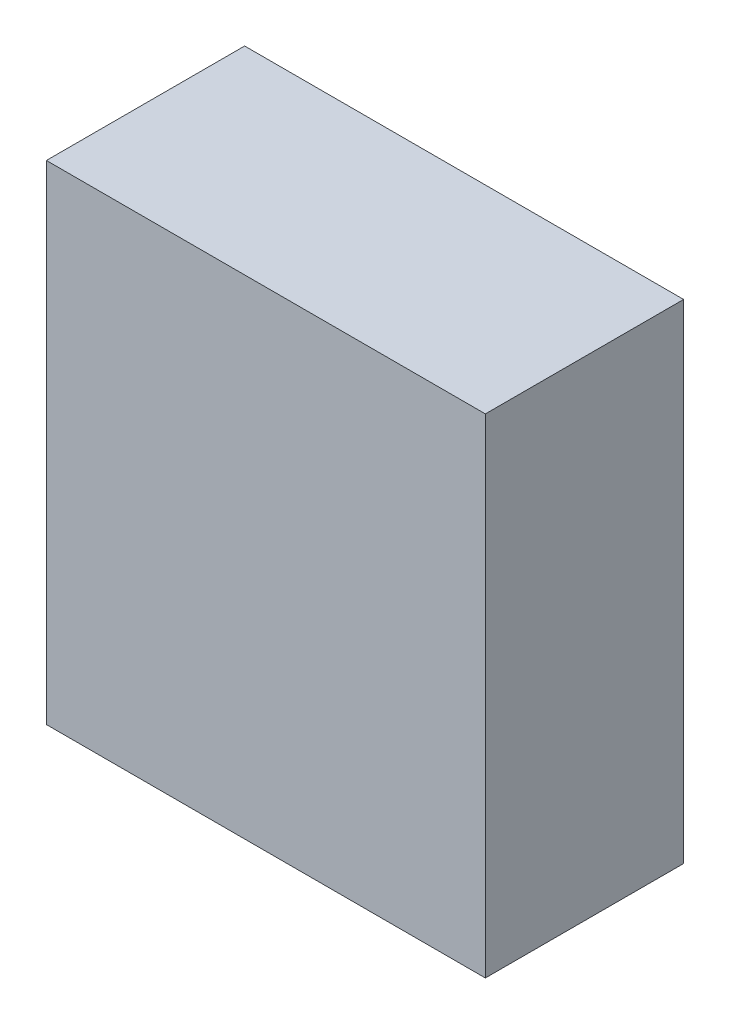
ISO-10303-21;
HEADER;
FILE_DESCRIPTION(('STEP AP214'),'2;1');
FILE_NAME('part.step','',(''),(''),'','','');
FILE_SCHEMA(('AUTOMOTIVE_DESIGN { 1 0 10303 214 1 1 1 1 }'));
ENDSEC;
DATA;
#1=APPLICATION_CONTEXT('core data for automotive mechanical design processes');
#2=APPLICATION_PROTOCOL_DEFINITION('international standard','automotive_design',2000,#1);
#3=PRODUCT_CONTEXT('',#1,'mechanical');
#4=PRODUCT('Part','Part','',(#3));
#5=PRODUCT_RELATED_PRODUCT_CATEGORY('part','',(#4));
#6=PRODUCT_DEFINITION_FORMATION('','',#4);
#7=PRODUCT_DEFINITION_CONTEXT('part definition',#1,'design');
#8=PRODUCT_DEFINITION('design','',#6,#7);
#9=PRODUCT_DEFINITION_SHAPE('','',#8);
#10=(LENGTH_UNIT() NAMED_UNIT(*) SI_UNIT(.MILLI.,.METRE.));
#11=(NAMED_UNIT(*) PLANE_ANGLE_UNIT() SI_UNIT($,.RADIAN.));
#12=(NAMED_UNIT(*) SI_UNIT($,.STERADIAN.) SOLID_ANGLE_UNIT());
#13=UNCERTAINTY_MEASURE_WITH_UNIT(LENGTH_MEASURE(1.E-05),#10,'distance_accuracy_value','');
#14=(GEOMETRIC_REPRESENTATION_CONTEXT(3) GLOBAL_UNCERTAINTY_ASSIGNED_CONTEXT((#13)) GLOBAL_UNIT_ASSIGNED_CONTEXT((#10,
#11,#12)) REPRESENTATION_CONTEXT('',''));
#15=CARTESIAN_POINT('',(0.,0.,0.));
#16=DIRECTION('',(0.,0.,1.));
#17=DIRECTION('',(1.,0.,0.));
#18=AXIS2_PLACEMENT_3D('',#15,#16,#17);
#19=CARTESIAN_POINT('',(1.54999944,1.72500036,1.39999974));
#20=DIRECTION('',(0.,0.,-1.));
#21=DIRECTION('',(-1.,0.,0.));
#22=AXIS2_PLACEMENT_3D('',#19,#20,#21);
#23=PLANE('',#22);
#24=DIRECTION('',(0.,1.,0.));
#25=VECTOR('',#24,1.);
#26=CARTESIAN_POINT('',(-1.54999944,1.72500036,1.39999974));
#27=LINE('',#26,#25);
#28=CARTESIAN_POINT('',(-1.54999944,1.72500036,1.39999974));
#29=VERTEX_POINT('',#28);
#30=CARTESIAN_POINT('',(-1.54999944,-1.72500036,1.39999974));
#31=VERTEX_POINT('',#30);
#32=EDGE_CURVE('E54',#29,#31,#27,.F.);
#33=ORIENTED_EDGE('',*,*,#32,.T.);
#34=DIRECTION('',(1.,0.,0.));
#35=VECTOR('',#34,1.);
#36=CARTESIAN_POINT('',(-1.54999944,-1.72500036,1.39999974));
#37=LINE('',#36,#35);
#38=CARTESIAN_POINT('',(1.54999944,-1.72500036,1.39999974));
#39=VERTEX_POINT('',#38);
#40=EDGE_CURVE('E56',#31,#39,#37,.T.);
#41=ORIENTED_EDGE('',*,*,#40,.T.);
#42=DIRECTION('',(0.,1.,0.));
#43=VECTOR('',#42,1.);
#44=CARTESIAN_POINT('',(1.54999944,-1.72500036,1.39999974));
#45=LINE('',#44,#43);
#46=CARTESIAN_POINT('',(1.54999944,1.72500036,1.39999974));
#47=VERTEX_POINT('',#46);
#48=EDGE_CURVE('E19',#39,#47,#45,.T.);
#49=ORIENTED_EDGE('',*,*,#48,.T.);
#50=DIRECTION('',(1.,0.,0.));
#51=VECTOR('',#50,1.);
#52=CARTESIAN_POINT('',(1.54999944,1.72500036,1.39999974));
#53=LINE('',#52,#51);
#54=EDGE_CURVE('E79',#47,#29,#53,.F.);
#55=ORIENTED_EDGE('',*,*,#54,.T.);
#56=EDGE_LOOP('',(#33,#41,#49,#55));
#57=FACE_BOUND('',#56,.T.);
#58=ADVANCED_FACE('F16',(#57),#23,.F.);
#59=CARTESIAN_POINT('',(1.54999944,-1.72500036,0.));
#60=DIRECTION('',(-1.,0.,0.));
#61=DIRECTION('',(0.,0.,1.));
#62=AXIS2_PLACEMENT_3D('',#59,#60,#61);
#63=PLANE('',#62);
#64=DIRECTION('',(0.,0.,-1.));
#65=VECTOR('',#64,1.);
#66=CARTESIAN_POINT('',(1.54999944,1.72500036,0.));
#67=LINE('',#66,#65);
#68=CARTESIAN_POINT('',(1.54999944,1.72500036,0.));
#69=VERTEX_POINT('',#68);
#70=EDGE_CURVE('E67',#69,#47,#67,.F.);
#71=ORIENTED_EDGE('',*,*,#70,.T.);
#72=ORIENTED_EDGE('',*,*,#48,.F.);
#73=DIRECTION('',(0.,0.,1.));
#74=VECTOR('',#73,1.);
#75=CARTESIAN_POINT('',(1.54999944,-1.72500036,0.));
#76=LINE('',#75,#74);
#77=CARTESIAN_POINT('',(1.54999944,-1.72500036,0.));
#78=VERTEX_POINT('',#77);
#79=EDGE_CURVE('E62',#39,#78,#76,.F.);
#80=ORIENTED_EDGE('',*,*,#79,.T.);
#81=DIRECTION('',(0.,1.,0.));
#82=VECTOR('',#81,1.);
#83=CARTESIAN_POINT('',(1.54999944,1.72500036,0.));
#84=LINE('',#83,#82);
#85=EDGE_CURVE('E82',#69,#78,#84,.F.);
#86=ORIENTED_EDGE('',*,*,#85,.F.);
#87=EDGE_LOOP('',(#71,#72,#80,#86));
#88=FACE_BOUND('',#87,.T.);
#89=ADVANCED_FACE('F64',(#88),#63,.F.);
#90=CARTESIAN_POINT('',(-1.54999944,-1.72500036,0.));
#91=DIRECTION('',(0.,1.,0.));
#92=DIRECTION('',(0.,0.,1.));
#93=AXIS2_PLACEMENT_3D('',#90,#91,#92);
#94=PLANE('',#93);
#95=ORIENTED_EDGE('',*,*,#79,.F.);
#96=ORIENTED_EDGE('',*,*,#40,.F.);
#97=DIRECTION('',(0.,0.,-1.));
#98=VECTOR('',#97,1.);
#99=CARTESIAN_POINT('',(-1.54999944,-1.72500036,0.));
#100=LINE('',#99,#98);
#101=CARTESIAN_POINT('',(-1.54999944,-1.72500036,0.));
#102=VERTEX_POINT('',#101);
#103=EDGE_CURVE('E74',#31,#102,#100,.T.);
#104=ORIENTED_EDGE('',*,*,#103,.T.);
#105=DIRECTION('',(-1.,0.,0.));
#106=VECTOR('',#105,1.);
#107=CARTESIAN_POINT('',(1.54999944,-1.72500036,0.));
#108=LINE('',#107,#106);
#109=EDGE_CURVE('E71',#78,#102,#108,.T.);
#110=ORIENTED_EDGE('',*,*,#109,.F.);
#111=EDGE_LOOP('',(#95,#96,#104,#110));
#112=FACE_BOUND('',#111,.T.);
#113=ADVANCED_FACE('F69',(#112),#94,.F.);
#114=CARTESIAN_POINT('',(-1.54999944,1.72500036,0.));
#115=DIRECTION('',(1.,0.,0.));
#116=DIRECTION('',(0.,0.,-1.));
#117=AXIS2_PLACEMENT_3D('',#114,#115,#116);
#118=PLANE('',#117);
#119=ORIENTED_EDGE('',*,*,#103,.F.);
#120=ORIENTED_EDGE('',*,*,#32,.F.);
#121=DIRECTION('',(0.,0.,-1.));
#122=VECTOR('',#121,1.);
#123=CARTESIAN_POINT('',(-1.54999944,1.72500036,0.));
#124=LINE('',#123,#122);
#125=CARTESIAN_POINT('',(-1.54999944,1.72500036,0.));
#126=VERTEX_POINT('',#125);
#127=EDGE_CURVE('E34',#29,#126,#124,.T.);
#128=ORIENTED_EDGE('',*,*,#127,.T.);
#129=DIRECTION('',(0.,1.,0.));
#130=VECTOR('',#129,1.);
#131=CARTESIAN_POINT('',(-1.54999944,1.72500036,0.));
#132=LINE('',#131,#130);
#133=EDGE_CURVE('E25',#102,#126,#132,.T.);
#134=ORIENTED_EDGE('',*,*,#133,.F.);
#135=EDGE_LOOP('',(#119,#120,#128,#134));
#136=FACE_BOUND('',#135,.T.);
#137=ADVANCED_FACE('F88',(#136),#118,.F.);
#138=CARTESIAN_POINT('',(1.54999944,1.72500036,0.));
#139=DIRECTION('',(0.,-1.,0.));
#140=DIRECTION('',(0.,0.,-1.));
#141=AXIS2_PLACEMENT_3D('',#138,#139,#140);
#142=PLANE('',#141);
#143=ORIENTED_EDGE('',*,*,#127,.F.);
#144=ORIENTED_EDGE('',*,*,#54,.F.);
#145=ORIENTED_EDGE('',*,*,#70,.F.);
#146=DIRECTION('',(-1.,0.,0.));
#147=VECTOR('',#146,1.);
#148=CARTESIAN_POINT('',(1.54999944,1.72500036,0.));
#149=LINE('',#148,#147);
#150=EDGE_CURVE('E11',#126,#69,#149,.F.);
#151=ORIENTED_EDGE('',*,*,#150,.F.);
#152=EDGE_LOOP('',(#143,#144,#145,#151));
#153=FACE_BOUND('',#152,.T.);
#154=ADVANCED_FACE('F90',(#153),#142,.F.);
#155=CARTESIAN_POINT('',(1.54999944,1.72500036,0.));
#156=DIRECTION('',(0.,0.,-1.));
#157=DIRECTION('',(-1.,0.,0.));
#158=AXIS2_PLACEMENT_3D('',#155,#156,#157);
#159=PLANE('',#158);
#160=ORIENTED_EDGE('',*,*,#133,.T.);
#161=ORIENTED_EDGE('',*,*,#150,.T.);
#162=ORIENTED_EDGE('',*,*,#85,.T.);
#163=ORIENTED_EDGE('',*,*,#109,.T.);
#164=EDGE_LOOP('',(#160,#161,#162,#163));
#165=FACE_BOUND('',#164,.T.);
#166=ADVANCED_FACE('F87',(#165),#159,.T.);
#167=CLOSED_SHELL('',(#58,#89,#113,#137,#154,#166));
#168=MANIFOLD_SOLID_BREP('B1',#167);
#169=ADVANCED_BREP_SHAPE_REPRESENTATION('',(#18,#168),#14);
#170=SHAPE_DEFINITION_REPRESENTATION(#9,#169);
ENDSEC;
END-ISO-10303-21;
